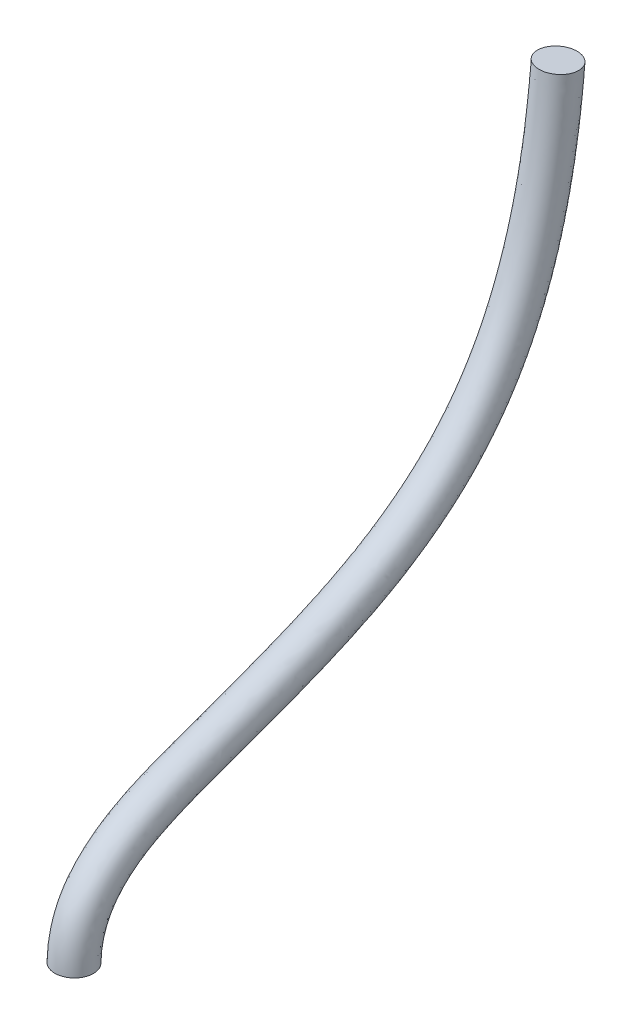
ISO-10303-21;
HEADER;
FILE_DESCRIPTION(('STEP AP214'),'2;1');
FILE_NAME('part.step','',(''),(''),'','','');
FILE_SCHEMA(('AUTOMOTIVE_DESIGN { 1 0 10303 214 1 1 1 1 }'));
ENDSEC;
DATA;
#1=APPLICATION_CONTEXT('core data for automotive mechanical design processes');
#2=APPLICATION_PROTOCOL_DEFINITION('international standard','automotive_design',2000,#1);
#3=PRODUCT_CONTEXT('',#1,'mechanical');
#4=PRODUCT('Part','Part','',(#3));
#5=PRODUCT_RELATED_PRODUCT_CATEGORY('part','',(#4));
#6=PRODUCT_DEFINITION_FORMATION('','',#4);
#7=PRODUCT_DEFINITION_CONTEXT('part definition',#1,'design');
#8=PRODUCT_DEFINITION('design','',#6,#7);
#9=PRODUCT_DEFINITION_SHAPE('','',#8);
#10=(LENGTH_UNIT() NAMED_UNIT(*) SI_UNIT(.MILLI.,.METRE.));
#11=(NAMED_UNIT(*) PLANE_ANGLE_UNIT() SI_UNIT($,.RADIAN.));
#12=(NAMED_UNIT(*) SI_UNIT($,.STERADIAN.) SOLID_ANGLE_UNIT());
#13=UNCERTAINTY_MEASURE_WITH_UNIT(LENGTH_MEASURE(1.E-05),#10,'distance_accuracy_value','');
#14=(GEOMETRIC_REPRESENTATION_CONTEXT(3) GLOBAL_UNCERTAINTY_ASSIGNED_CONTEXT((#13)) GLOBAL_UNIT_ASSIGNED_CONTEXT((#10,
#11,#12)) REPRESENTATION_CONTEXT('',''));
#15=CARTESIAN_POINT('',(0.,0.,0.));
#16=DIRECTION('',(0.,0.,1.));
#17=DIRECTION('',(1.,0.,0.));
#18=AXIS2_PLACEMENT_3D('',#15,#16,#17);
#19=CARTESIAN_POINT('',(0.,-8.34389058810441,42.3868059782364));
#20=DIRECTION('',(0.,0.999787116832098,-0.0206330079377902));
#21=DIRECTION('',(0.,0.0206330079377902,0.999787116832098));
#22=AXIS2_PLACEMENT_3D('',#19,#20,#21);
#23=PLANE('',#22);
#24=CARTESIAN_POINT('',(0.,-8.34389058810441,42.3868059782364));
#25=DIRECTION('',(0.,0.999787116832098,-0.0206330079377902));
#26=DIRECTION('',(0.,0.0206330079377902,0.999787116832098));
#27=AXIS2_PLACEMENT_3D('',#24,#25,#26);
#28=CIRCLE('',#27,1.651);
#29=CARTESIAN_POINT('',(0.,-8.30982549199912,44.0374545081262));
#30=VERTEX_POINT('',#29);
#31=EDGE_CURVE('E45',#30,#30,#28,.T.);
#32=ORIENTED_EDGE('',*,*,#31,.F.);
#33=EDGE_LOOP('',(#32));
#34=FACE_BOUND('',#33,.T.);
#35=ADVANCED_FACE('F38',(#34),#23,.F.);
#36=CARTESIAN_POINT('',(0.,38.3572358689595,0.476805978236412));
#37=DIRECTION('',(0.,0.996389274302109,-0.0849023795645158));
#38=DIRECTION('',(0.,0.0849023795645158,0.996389274302109));
#39=AXIS2_PLACEMENT_3D('',#36,#37,#38);
#40=PLANE('',#39);
#41=CARTESIAN_POINT('',(0.,38.3572358689595,0.476805978236412));
#42=DIRECTION('',(0.,0.996389274302109,-0.0849023795645158));
#43=DIRECTION('',(0.,0.0849023795645158,0.996389274302109));
#44=AXIS2_PLACEMENT_3D('',#41,#42,#43);
#45=CIRCLE('',#44,1.651);
#46=CARTESIAN_POINT('',(0.,38.4974096976205,2.12184467010919));
#47=VERTEX_POINT('',#46);
#48=EDGE_CURVE('E12',#47,#47,#45,.T.);
#49=ORIENTED_EDGE('',*,*,#48,.T.);
#50=EDGE_LOOP('',(#49));
#51=FACE_BOUND('',#50,.T.);
#52=ADVANCED_FACE('F52',(#51),#40,.T.);
#53=CARTESIAN_POINT('',(0.,-8.30982549199912,44.0374545081262));
#54=CARTESIAN_POINT('',(0.,-6.49318001739834,43.9999636654721));
#55=CARTESIAN_POINT('',(0.,-4.88373136265343,43.5353942851463));
#56=CARTESIAN_POINT('',(0.,-2.18752799460318,41.969941238293));
#57=CARTESIAN_POINT('',(0.,-1.11068190667827,40.8903610857216));
#58=CARTESIAN_POINT('',(0.,1.52275053639768,37.2800246247999));
#59=CARTESIAN_POINT('',(0.,2.55102319964497,34.3660690444159));
#60=CARTESIAN_POINT('',(0.,4.98333345939271,27.6249205260066));
#61=CARTESIAN_POINT('',(0.,6.3246899502006,23.8611996954574));
#62=CARTESIAN_POINT('',(0.,9.46778903259171,17.1444381974731));
#63=CARTESIAN_POINT('',(0.,11.261966281335,14.1979932053113));
#64=CARTESIAN_POINT('',(0.,16.0031827778926,9.18159339333435));
#65=CARTESIAN_POINT('',(0.,18.953554896036,7.09137030748561));
#66=CARTESIAN_POINT('',(0.,26.9492330655664,3.83189859745831));
#67=CARTESIAN_POINT('',(0.,32.0012487697577,2.6753828657089));
#68=CARTESIAN_POINT('',(0.,38.4974096976205,2.1218446701092));
#69=CARTESIAN_POINT('',(3.302,-8.30982549199912,44.0374545081262));
#70=CARTESIAN_POINT('',(3.302,-6.49318001739834,43.9999636654721));
#71=CARTESIAN_POINT('',(3.302,-4.88373136265343,43.5353942851463));
#72=CARTESIAN_POINT('',(3.302,-2.18752799460318,41.969941238293));
#73=CARTESIAN_POINT('',(3.302,-1.11068190667827,40.8903610857216));
#74=CARTESIAN_POINT('',(3.302,1.52275053639768,37.2800246247999));
#75=CARTESIAN_POINT('',(3.302,2.55102319964497,34.3660690444159));
#76=CARTESIAN_POINT('',(3.302,4.98333345939271,27.6249205260066));
#77=CARTESIAN_POINT('',(3.302,6.3246899502006,23.8611996954574));
#78=CARTESIAN_POINT('',(3.302,9.46778903259171,17.1444381974731));
#79=CARTESIAN_POINT('',(3.302,11.261966281335,14.1979932053113));
#80=CARTESIAN_POINT('',(3.302,16.0031827778926,9.18159339333435));
#81=CARTESIAN_POINT('',(3.302,18.953554896036,7.09137030748561));
#82=CARTESIAN_POINT('',(3.302,26.9492330655664,3.83189859745831));
#83=CARTESIAN_POINT('',(3.302,32.0012487697577,2.6753828657089));
#84=CARTESIAN_POINT('',(3.302,38.4974096976205,2.1218446701092));
#85=CARTESIAN_POINT('',(3.302,-8.37795568420971,40.7361574483466));
#86=CARTESIAN_POINT('',(3.302,-7.06586320829793,40.7090792645008));
#87=CARTESIAN_POINT('',(3.302,-6.06351548171842,40.402172525384));
#88=CARTESIAN_POINT('',(3.302,-4.32371315576179,39.3920191780649));
#89=CARTESIAN_POINT('',(3.302,-3.57634994100593,38.6674690404854));
#90=CARTESIAN_POINT('',(3.302,-1.54909094724363,35.8881734863106));
#91=CARTESIAN_POINT('',(3.302,-0.552817992927241,33.2393861276746));
#92=CARTESIAN_POINT('',(3.302,1.87404324759382,26.5133395674366));
#93=CARTESIAN_POINT('',(3.302,3.239258633607,22.6640259284465));
#94=CARTESIAN_POINT('',(3.302,6.57172860374642,15.5425813288448));
#95=CARTESIAN_POINT('',(3.302,8.54654851674989,12.2638546852071));
#96=CARTESIAN_POINT('',(3.302,13.9190802750829,6.57949765991205));
#97=CARTESIAN_POINT('',(3.302,17.3134592383852,4.19413554149012));
#98=CARTESIAN_POINT('',(3.302,26.0963657969539,0.613746879487572));
#99=CARTESIAN_POINT('',(3.302,31.4781837328121,-0.594012558085154));
#100=CARTESIAN_POINT('',(3.302,38.2170620402985,-1.16823271363637));
#101=CARTESIAN_POINT('',(0.,-8.37795568420971,40.7361574483466));
#102=CARTESIAN_POINT('',(0.,-7.06586320829793,40.7090792645008));
#103=CARTESIAN_POINT('',(0.,-6.06351548171842,40.402172525384));
#104=CARTESIAN_POINT('',(0.,-4.32371315576179,39.3920191780649));
#105=CARTESIAN_POINT('',(0.,-3.57634994100593,38.6674690404854));
#106=CARTESIAN_POINT('',(0.,-1.54909094724363,35.8881734863106));
#107=CARTESIAN_POINT('',(0.,-0.552817992927241,33.2393861276746));
#108=CARTESIAN_POINT('',(0.,1.87404324759382,26.5133395674366));
#109=CARTESIAN_POINT('',(0.,3.239258633607,22.6640259284465));
#110=CARTESIAN_POINT('',(0.,6.57172860374642,15.5425813288448));
#111=CARTESIAN_POINT('',(0.,8.54654851674989,12.2638546852071));
#112=CARTESIAN_POINT('',(0.,13.9190802750829,6.57949765991205));
#113=CARTESIAN_POINT('',(0.,17.3134592383852,4.19413554149012));
#114=CARTESIAN_POINT('',(0.,26.0963657969539,0.613746879487572));
#115=CARTESIAN_POINT('',(0.,31.4781837328121,-0.594012558085154));
#116=CARTESIAN_POINT('',(0.,38.2170620402985,-1.16823271363637));
#117=CARTESIAN_POINT('',(-3.302,-8.37795568420971,40.7361574483466));
#118=CARTESIAN_POINT('',(-3.302,-7.06586320829793,40.7090792645008));
#119=CARTESIAN_POINT('',(-3.302,-6.06351548171842,40.402172525384));
#120=CARTESIAN_POINT('',(-3.302,-4.32371315576179,39.3920191780649));
#121=CARTESIAN_POINT('',(-3.302,-3.57634994100593,38.6674690404854));
#122=CARTESIAN_POINT('',(-3.302,-1.54909094724363,35.8881734863106));
#123=CARTESIAN_POINT('',(-3.302,-0.552817992927241,33.2393861276746));
#124=CARTESIAN_POINT('',(-3.302,1.87404324759382,26.5133395674366));
#125=CARTESIAN_POINT('',(-3.302,3.239258633607,22.6640259284465));
#126=CARTESIAN_POINT('',(-3.302,6.57172860374642,15.5425813288448));
#127=CARTESIAN_POINT('',(-3.302,8.54654851674989,12.2638546852071));
#128=CARTESIAN_POINT('',(-3.302,13.9190802750829,6.57949765991205));
#129=CARTESIAN_POINT('',(-3.302,17.3134592383852,4.19413554149012));
#130=CARTESIAN_POINT('',(-3.302,26.0963657969539,0.613746879487572));
#131=CARTESIAN_POINT('',(-3.302,31.4781837328121,-0.594012558085154));
#132=CARTESIAN_POINT('',(-3.302,38.2170620402985,-1.16823271363637));
#133=CARTESIAN_POINT('',(-3.302,-8.30982549199912,44.0374545081262));
#134=CARTESIAN_POINT('',(-3.302,-6.49318001739834,43.9999636654721));
#135=CARTESIAN_POINT('',(-3.302,-4.88373136265343,43.5353942851463));
#136=CARTESIAN_POINT('',(-3.302,-2.18752799460318,41.969941238293));
#137=CARTESIAN_POINT('',(-3.302,-1.11068190667827,40.8903610857216));
#138=CARTESIAN_POINT('',(-3.302,1.52275053639768,37.2800246247999));
#139=CARTESIAN_POINT('',(-3.302,2.55102319964497,34.3660690444159));
#140=CARTESIAN_POINT('',(-3.302,4.98333345939271,27.6249205260066));
#141=CARTESIAN_POINT('',(-3.302,6.3246899502006,23.8611996954574));
#142=CARTESIAN_POINT('',(-3.302,9.46778903259171,17.1444381974731));
#143=CARTESIAN_POINT('',(-3.302,11.261966281335,14.1979932053113));
#144=CARTESIAN_POINT('',(-3.302,16.0031827778926,9.18159339333435));
#145=CARTESIAN_POINT('',(-3.302,18.953554896036,7.09137030748561));
#146=CARTESIAN_POINT('',(-3.302,26.9492330655664,3.83189859745831));
#147=CARTESIAN_POINT('',(-3.302,32.0012487697577,2.6753828657089));
#148=CARTESIAN_POINT('',(-3.302,38.4974096976205,2.1218446701092));
#149=CARTESIAN_POINT('',(0.,-8.30982549199912,44.0374545081262));
#150=CARTESIAN_POINT('',(0.,-6.49318001739834,43.9999636654721));
#151=CARTESIAN_POINT('',(0.,-4.88373136265343,43.5353942851463));
#152=CARTESIAN_POINT('',(0.,-2.18752799460318,41.969941238293));
#153=CARTESIAN_POINT('',(0.,-1.11068190667827,40.8903610857216));
#154=CARTESIAN_POINT('',(0.,1.52275053639768,37.2800246247999));
#155=CARTESIAN_POINT('',(0.,2.55102319964497,34.3660690444159));
#156=CARTESIAN_POINT('',(0.,4.98333345939271,27.6249205260066));
#157=CARTESIAN_POINT('',(0.,6.3246899502006,23.8611996954574));
#158=CARTESIAN_POINT('',(0.,9.46778903259171,17.1444381974731));
#159=CARTESIAN_POINT('',(0.,11.261966281335,14.1979932053113));
#160=CARTESIAN_POINT('',(0.,16.0031827778926,9.18159339333435));
#161=CARTESIAN_POINT('',(0.,18.953554896036,7.09137030748561));
#162=CARTESIAN_POINT('',(0.,26.9492330655664,3.83189859745831));
#163=CARTESIAN_POINT('',(0.,32.0012487697577,2.6753828657089));
#164=CARTESIAN_POINT('',(0.,38.4974096976205,2.1218446701092));
#165=(BOUNDED_SURFACE() B_SPLINE_SURFACE(3,3,((#53,#54,#55,#56,#57,#58,#59,#60,#61,#62,#63,#64,
#65,#66,#67,#68),(#69,#70,#71,#72,#73,#74,#75,#76,#77,#78,#79,#80,#81,#82,#83,#84),(#85,#86,#87,
#88,#89,#90,#91,#92,#93,#94,#95,#96,#97,#98,#99,#100),(#101,#102,#103,#104,#105,#106,#107,#108,
#109,#110,#111,#112,#113,#114,#115,#116),(#117,#118,#119,#120,#121,#122,#123,#124,#125,#126,
#127,#128,#129,#130,#131,#132),(#133,#134,#135,#136,#137,#138,#139,#140,#141,#142,#143,#144,
#145,#146,#147,#148),(#149,#150,#151,#152,#153,#154,#155,#156,#157,#158,#159,#160,#161,#162,
#163,#164)),.UNSPECIFIED.,.T.,.F.,.F.) B_SPLINE_SURFACE_WITH_KNOTS((4,3,4),(4,2,2,2,2,2,2,4),
(0.,0.5,1.),(0.,0.0618373664271567,0.123674732854313,0.247349465708627,0.43551209928147,
0.623674732854313,0.811837366427157,1.),
.UNSPECIFIED.) GEOMETRIC_REPRESENTATION_ITEM() RATIONAL_B_SPLINE_SURFACE(((1.,1.,1.,1.,1.,1.,1.,
1.,1.,1.,1.,1.,1.,1.,1.,1.),(0.333333333333333,0.333333333333333,0.333333333333333,
0.333333333333333,0.333333333333333,0.333333333333333,0.333333333333333,0.333333333333333,
0.333333333333333,0.333333333333333,0.333333333333333,0.333333333333333,0.333333333333333,
0.333333333333333,0.333333333333333,0.333333333333333),(0.333333333333333,0.333333333333333,
0.333333333333333,0.333333333333333,0.333333333333333,0.333333333333333,0.333333333333333,
0.333333333333333,0.333333333333333,0.333333333333333,0.333333333333333,0.333333333333333,
0.333333333333333,0.333333333333333,0.333333333333333,0.333333333333333),(1.,1.,1.,1.,1.,1.,1.,
1.,1.,1.,1.,1.,1.,1.,1.,1.),(0.333333333333333,0.333333333333333,0.333333333333333,
0.333333333333333,0.333333333333333,0.333333333333333,0.333333333333333,0.333333333333333,
0.333333333333333,0.333333333333333,0.333333333333333,0.333333333333333,0.333333333333333,
0.333333333333333,0.333333333333333,0.333333333333333),(0.333333333333333,0.333333333333333,
0.333333333333333,0.333333333333333,0.333333333333333,0.333333333333333,0.333333333333333,
0.333333333333333,0.333333333333333,0.333333333333333,0.333333333333333,0.333333333333333,
0.333333333333333,0.333333333333333,0.333333333333333,0.333333333333333),(1.,1.,1.,1.,1.,1.,1.,
1.,1.,1.,1.,1.,1.,1.,1.,1.))) REPRESENTATION_ITEM('') SURFACE());
#166=ORIENTED_EDGE('',*,*,#48,.F.);
#167=EDGE_LOOP('',(#166));
#168=FACE_BOUND('',#167,.T.);
#169=ORIENTED_EDGE('',*,*,#31,.T.);
#170=EDGE_LOOP('',(#169));
#171=FACE_BOUND('',#170,.T.);
#172=ADVANCED_FACE('F54',(#168,#171),#165,.T.);
#173=CLOSED_SHELL('',(#35,#52,#172));
#174=MANIFOLD_SOLID_BREP('B2',#173);
#175=ADVANCED_BREP_SHAPE_REPRESENTATION('',(#18,#174),#14);
#176=SHAPE_DEFINITION_REPRESENTATION(#9,#175);
ENDSEC;
END-ISO-10303-21;
